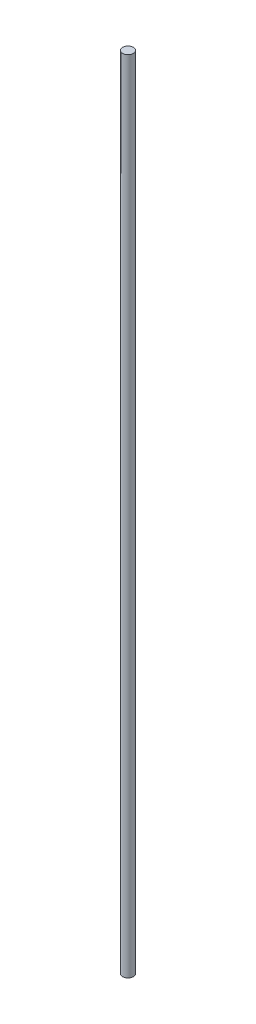
ISO-10303-21;
HEADER;
FILE_DESCRIPTION(('STEP AP214'),'2;1');
FILE_NAME('part.step','',(''),(''),'','','');
FILE_SCHEMA(('AUTOMOTIVE_DESIGN { 1 0 10303 214 1 1 1 1 }'));
ENDSEC;
DATA;
#1=APPLICATION_CONTEXT('core data for automotive mechanical design processes');
#2=APPLICATION_PROTOCOL_DEFINITION('international standard','automotive_design',2000,#1);
#3=PRODUCT_CONTEXT('',#1,'mechanical');
#4=PRODUCT('Part','Part','',(#3));
#5=PRODUCT_RELATED_PRODUCT_CATEGORY('part','',(#4));
#6=PRODUCT_DEFINITION_FORMATION('','',#4);
#7=PRODUCT_DEFINITION_CONTEXT('part definition',#1,'design');
#8=PRODUCT_DEFINITION('design','',#6,#7);
#9=PRODUCT_DEFINITION_SHAPE('','',#8);
#10=(LENGTH_UNIT() NAMED_UNIT(*) SI_UNIT(.MILLI.,.METRE.));
#11=(NAMED_UNIT(*) PLANE_ANGLE_UNIT() SI_UNIT($,.RADIAN.));
#12=(NAMED_UNIT(*) SI_UNIT($,.STERADIAN.) SOLID_ANGLE_UNIT());
#13=UNCERTAINTY_MEASURE_WITH_UNIT(LENGTH_MEASURE(1.E-05),#10,'distance_accuracy_value','');
#14=(GEOMETRIC_REPRESENTATION_CONTEXT(3) GLOBAL_UNCERTAINTY_ASSIGNED_CONTEXT((#13)) GLOBAL_UNIT_ASSIGNED_CONTEXT((#10,
#11,#12)) REPRESENTATION_CONTEXT('',''));
#15=CARTESIAN_POINT('',(0.,0.,0.));
#16=DIRECTION('',(0.,0.,1.));
#17=DIRECTION('',(1.,0.,0.));
#18=AXIS2_PLACEMENT_3D('',#15,#16,#17);
#19=CARTESIAN_POINT('',(0.,600.,0.));
#20=DIRECTION('',(0.,-1.,0.));
#21=DIRECTION('',(0.,0.,-1.));
#22=AXIS2_PLACEMENT_3D('',#19,#20,#21);
#23=CYLINDRICAL_SURFACE('',#22,4.);
#24=CARTESIAN_POINT('',(0.,600.,0.));
#25=DIRECTION('',(0.,1.,0.));
#26=DIRECTION('',(0.,0.,1.));
#27=AXIS2_PLACEMENT_3D('',#24,#25,#26);
#28=CIRCLE('',#27,4.);
#29=CARTESIAN_POINT('',(0.,600.,4.));
#30=VERTEX_POINT('',#29);
#31=EDGE_CURVE('E10',#30,#30,#28,.T.);
#32=ORIENTED_EDGE('',*,*,#31,.F.);
#33=EDGE_LOOP('',(#32));
#34=FACE_BOUND('',#33,.T.);
#35=CARTESIAN_POINT('',(0.,0.,0.));
#36=DIRECTION('',(0.,1.,0.));
#37=DIRECTION('',(0.,0.,1.));
#38=AXIS2_PLACEMENT_3D('',#35,#36,#37);
#39=CIRCLE('',#38,4.);
#40=CARTESIAN_POINT('',(0.,0.,4.));
#41=VERTEX_POINT('',#40);
#42=EDGE_CURVE('E45',#41,#41,#39,.T.);
#43=ORIENTED_EDGE('',*,*,#42,.T.);
#44=EDGE_LOOP('',(#43));
#45=FACE_BOUND('',#44,.T.);
#46=ADVANCED_FACE('F42',(#34,#45),#23,.T.);
#47=CARTESIAN_POINT('',(0.,600.,0.));
#48=DIRECTION('',(0.,1.,0.));
#49=DIRECTION('',(0.,0.,1.));
#50=AXIS2_PLACEMENT_3D('',#47,#48,#49);
#51=PLANE('',#50);
#52=ORIENTED_EDGE('',*,*,#31,.T.);
#53=EDGE_LOOP('',(#52));
#54=FACE_BOUND('',#53,.T.);
#55=ADVANCED_FACE('F59',(#54),#51,.T.);
#56=CARTESIAN_POINT('',(0.,0.,0.));
#57=DIRECTION('',(0.,1.,0.));
#58=DIRECTION('',(0.,0.,1.));
#59=AXIS2_PLACEMENT_3D('',#56,#57,#58);
#60=PLANE('',#59);
#61=ORIENTED_EDGE('',*,*,#42,.F.);
#62=EDGE_LOOP('',(#61));
#63=FACE_BOUND('',#62,.T.);
#64=ADVANCED_FACE('F57',(#63),#60,.F.);
#65=CLOSED_SHELL('',(#46,#55,#64));
#66=MANIFOLD_SOLID_BREP('B2',#65);
#67=ADVANCED_BREP_SHAPE_REPRESENTATION('',(#18,#66),#14);
#68=SHAPE_DEFINITION_REPRESENTATION(#9,#67);
ENDSEC;
END-ISO-10303-21;
